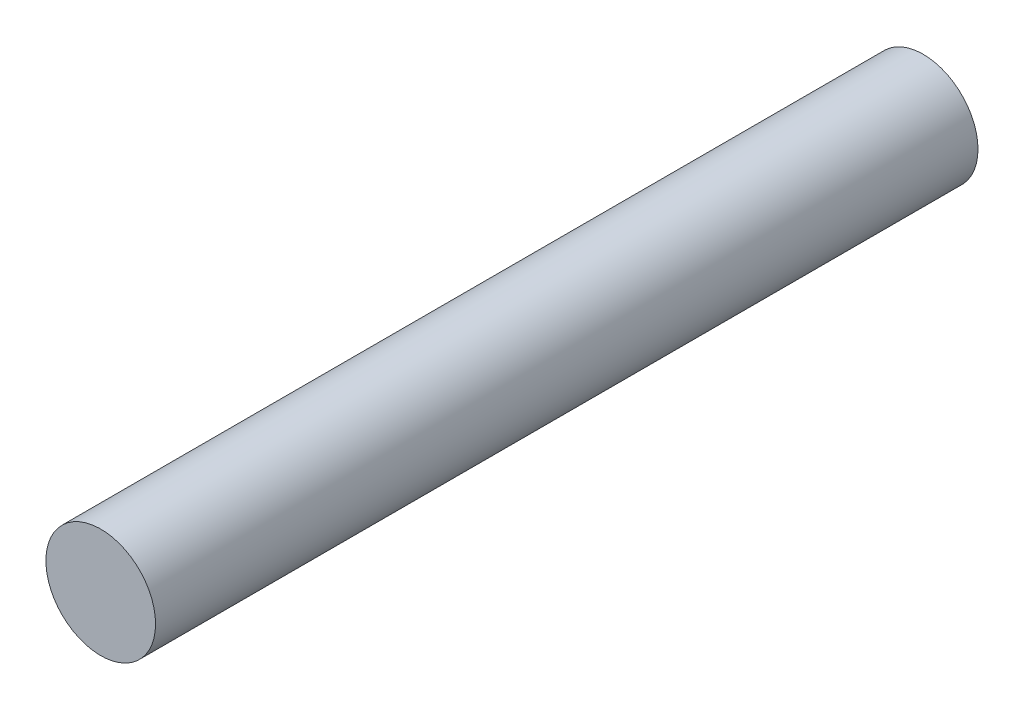
ISO-10303-21;
HEADER;
FILE_DESCRIPTION(('STEP AP214'),'2;1');
FILE_NAME('part.step','',(''),(''),'','','');
FILE_SCHEMA(('AUTOMOTIVE_DESIGN { 1 0 10303 214 1 1 1 1 }'));
ENDSEC;
DATA;
#1=APPLICATION_CONTEXT('core data for automotive mechanical design processes');
#2=APPLICATION_PROTOCOL_DEFINITION('international standard','automotive_design',2000,#1);
#3=PRODUCT_CONTEXT('',#1,'mechanical');
#4=PRODUCT('Part','Part','',(#3));
#5=PRODUCT_RELATED_PRODUCT_CATEGORY('part','',(#4));
#6=PRODUCT_DEFINITION_FORMATION('','',#4);
#7=PRODUCT_DEFINITION_CONTEXT('part definition',#1,'design');
#8=PRODUCT_DEFINITION('design','',#6,#7);
#9=PRODUCT_DEFINITION_SHAPE('','',#8);
#10=(LENGTH_UNIT() NAMED_UNIT(*) SI_UNIT(.MILLI.,.METRE.));
#11=(NAMED_UNIT(*) PLANE_ANGLE_UNIT() SI_UNIT($,.RADIAN.));
#12=(NAMED_UNIT(*) SI_UNIT($,.STERADIAN.) SOLID_ANGLE_UNIT());
#13=UNCERTAINTY_MEASURE_WITH_UNIT(LENGTH_MEASURE(1.E-05),#10,'distance_accuracy_value','');
#14=(GEOMETRIC_REPRESENTATION_CONTEXT(3) GLOBAL_UNCERTAINTY_ASSIGNED_CONTEXT((#13)) GLOBAL_UNIT_ASSIGNED_CONTEXT((#10,
#11,#12)) REPRESENTATION_CONTEXT('',''));
#15=CARTESIAN_POINT('',(0.,0.,0.));
#16=DIRECTION('',(0.,0.,1.));
#17=DIRECTION('',(1.,0.,0.));
#18=AXIS2_PLACEMENT_3D('',#15,#16,#17);
#19=CARTESIAN_POINT('',(0.,0.,60.));
#20=DIRECTION('',(0.,0.,-1.));
#21=DIRECTION('',(-1.,0.,0.));
#22=AXIS2_PLACEMENT_3D('',#19,#20,#21);
#23=CYLINDRICAL_SURFACE('',#22,4.);
#24=CARTESIAN_POINT('',(0.,0.,60.));
#25=DIRECTION('',(0.,0.,1.));
#26=DIRECTION('',(1.,0.,0.));
#27=AXIS2_PLACEMENT_3D('',#24,#25,#26);
#28=CIRCLE('',#27,4.);
#29=CARTESIAN_POINT('',(4.,0.,60.));
#30=VERTEX_POINT('',#29);
#31=EDGE_CURVE('E10',#30,#30,#28,.T.);
#32=ORIENTED_EDGE('',*,*,#31,.F.);
#33=EDGE_LOOP('',(#32));
#34=FACE_BOUND('',#33,.T.);
#35=CARTESIAN_POINT('',(0.,0.,0.));
#36=DIRECTION('',(0.,0.,1.));
#37=DIRECTION('',(1.,0.,0.));
#38=AXIS2_PLACEMENT_3D('',#35,#36,#37);
#39=CIRCLE('',#38,4.);
#40=CARTESIAN_POINT('',(4.,0.,0.));
#41=VERTEX_POINT('',#40);
#42=EDGE_CURVE('E38',#41,#41,#39,.T.);
#43=ORIENTED_EDGE('',*,*,#42,.T.);
#44=EDGE_LOOP('',(#43));
#45=FACE_BOUND('',#44,.T.);
#46=ADVANCED_FACE('F35',(#34,#45),#23,.T.);
#47=CARTESIAN_POINT('',(0.,0.,60.));
#48=DIRECTION('',(0.,0.,1.));
#49=DIRECTION('',(1.,0.,0.));
#50=AXIS2_PLACEMENT_3D('',#47,#48,#49);
#51=PLANE('',#50);
#52=ORIENTED_EDGE('',*,*,#31,.T.);
#53=EDGE_LOOP('',(#52));
#54=FACE_BOUND('',#53,.T.);
#55=ADVANCED_FACE('F50',(#54),#51,.T.);
#56=CARTESIAN_POINT('',(0.,0.,0.));
#57=DIRECTION('',(0.,0.,1.));
#58=DIRECTION('',(1.,0.,0.));
#59=AXIS2_PLACEMENT_3D('',#56,#57,#58);
#60=PLANE('',#59);
#61=ORIENTED_EDGE('',*,*,#42,.F.);
#62=EDGE_LOOP('',(#61));
#63=FACE_BOUND('',#62,.T.);
#64=ADVANCED_FACE('F48',(#63),#60,.F.);
#65=CLOSED_SHELL('',(#46,#55,#64));
#66=MANIFOLD_SOLID_BREP('B2',#65);
#67=ADVANCED_BREP_SHAPE_REPRESENTATION('',(#18,#66),#14);
#68=SHAPE_DEFINITION_REPRESENTATION(#9,#67);
ENDSEC;
END-ISO-10303-21;
